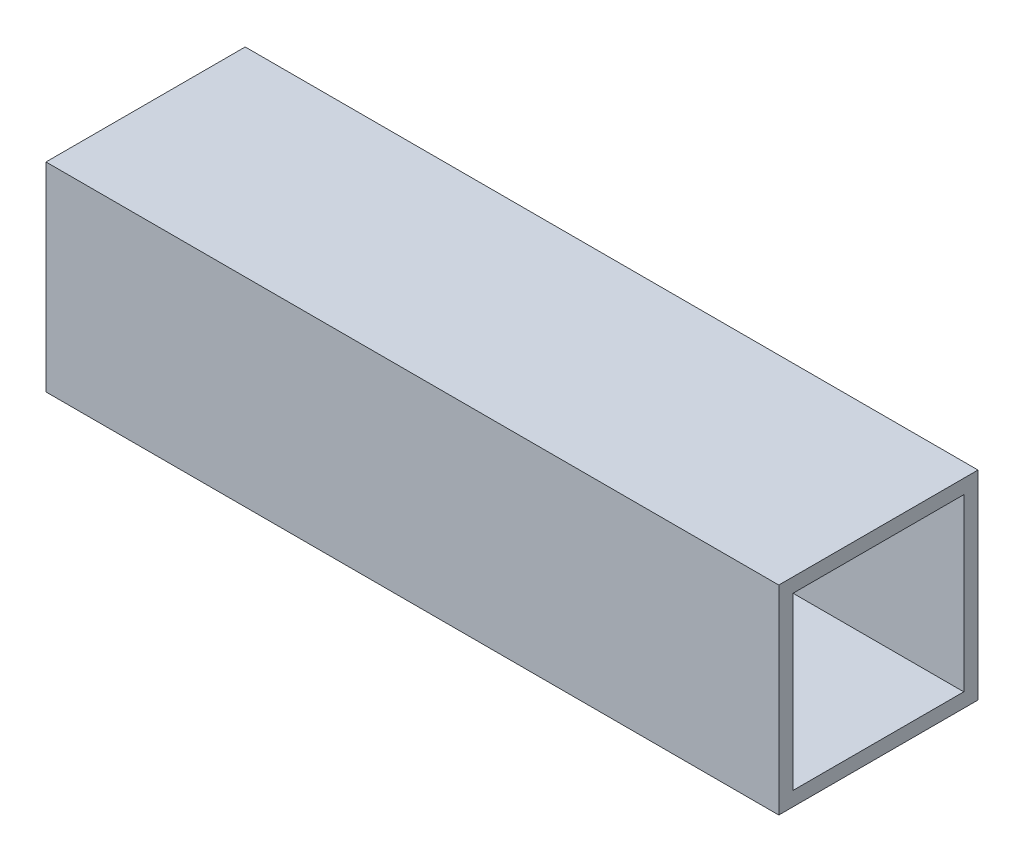
ISO-10303-21;
HEADER;
FILE_DESCRIPTION(('STEP AP214'),'2;1');
FILE_NAME('part.step','',(''),(''),'','','');
FILE_SCHEMA(('AUTOMOTIVE_DESIGN { 1 0 10303 214 1 1 1 1 }'));
ENDSEC;
DATA;
#1=APPLICATION_CONTEXT('core data for automotive mechanical design processes');
#2=APPLICATION_PROTOCOL_DEFINITION('international standard','automotive_design',2000,#1);
#3=PRODUCT_CONTEXT('',#1,'mechanical');
#4=PRODUCT('Part','Part','',(#3));
#5=PRODUCT_RELATED_PRODUCT_CATEGORY('part','',(#4));
#6=PRODUCT_DEFINITION_FORMATION('','',#4);
#7=PRODUCT_DEFINITION_CONTEXT('part definition',#1,'design');
#8=PRODUCT_DEFINITION('design','',#6,#7);
#9=PRODUCT_DEFINITION_SHAPE('','',#8);
#10=(LENGTH_UNIT() NAMED_UNIT(*) SI_UNIT(.MILLI.,.METRE.));
#11=(NAMED_UNIT(*) PLANE_ANGLE_UNIT() SI_UNIT($,.RADIAN.));
#12=(NAMED_UNIT(*) SI_UNIT($,.STERADIAN.) SOLID_ANGLE_UNIT());
#13=UNCERTAINTY_MEASURE_WITH_UNIT(LENGTH_MEASURE(1.E-05),#10,'distance_accuracy_value','');
#14=(GEOMETRIC_REPRESENTATION_CONTEXT(3) GLOBAL_UNCERTAINTY_ASSIGNED_CONTEXT((#13)) GLOBAL_UNIT_ASSIGNED_CONTEXT((#10,
#11,#12)) REPRESENTATION_CONTEXT('',''));
#15=CARTESIAN_POINT('',(0.,0.,0.));
#16=DIRECTION('',(0.,0.,1.));
#17=DIRECTION('',(1.,0.,0.));
#18=AXIS2_PLACEMENT_3D('',#15,#16,#17);
#19=CARTESIAN_POINT('',(-81.75625,-22.225,22.225));
#20=DIRECTION('',(0.,-1.,0.));
#21=DIRECTION('',(0.,0.,-1.));
#22=AXIS2_PLACEMENT_3D('',#19,#20,#21);
#23=PLANE('',#22);
#24=DIRECTION('',(1.,0.,0.));
#25=VECTOR('',#24,1.);
#26=CARTESIAN_POINT('',(-81.75625,-22.225,22.225));
#27=LINE('',#26,#25);
#28=CARTESIAN_POINT('',(-81.75625,-22.225,22.225));
#29=VERTEX_POINT('',#28);
#30=CARTESIAN_POINT('',(81.75625,-22.225,22.225));
#31=VERTEX_POINT('',#30);
#32=EDGE_CURVE('E114',#29,#31,#27,.T.);
#33=ORIENTED_EDGE('',*,*,#32,.F.);
#34=DIRECTION('',(0.,0.,-1.));
#35=VECTOR('',#34,1.);
#36=CARTESIAN_POINT('',(-81.75625,-22.225,0.));
#37=LINE('',#36,#35);
#38=CARTESIAN_POINT('',(-81.75625,-22.225,-22.225));
#39=VERTEX_POINT('',#38);
#40=EDGE_CURVE('E136',#29,#39,#37,.T.);
#41=ORIENTED_EDGE('',*,*,#40,.T.);
#42=DIRECTION('',(-1.,0.,0.));
#43=VECTOR('',#42,1.);
#44=CARTESIAN_POINT('',(-81.75625,-22.225,-22.225));
#45=LINE('',#44,#43);
#46=CARTESIAN_POINT('',(81.75625,-22.225,-22.225));
#47=VERTEX_POINT('',#46);
#48=EDGE_CURVE('E131',#47,#39,#45,.T.);
#49=ORIENTED_EDGE('',*,*,#48,.F.);
#50=DIRECTION('',(0.,0.,-1.));
#51=VECTOR('',#50,1.);
#52=CARTESIAN_POINT('',(81.75625,-22.225,0.));
#53=LINE('',#52,#51);
#54=EDGE_CURVE('E106',#31,#47,#53,.T.);
#55=ORIENTED_EDGE('',*,*,#54,.F.);
#56=EDGE_LOOP('',(#33,#41,#49,#55));
#57=FACE_BOUND('',#56,.T.);
#58=ADVANCED_FACE('F17',(#57),#23,.T.);
#59=CARTESIAN_POINT('',(-81.75625,19.05,-19.05));
#60=DIRECTION('',(0.,0.,1.));
#61=DIRECTION('',(1.,0.,0.));
#62=AXIS2_PLACEMENT_3D('',#59,#60,#61);
#63=PLANE('',#62);
#64=DIRECTION('',(1.,0.,0.));
#65=VECTOR('',#64,1.);
#66=CARTESIAN_POINT('',(-81.75625,19.05,-19.05));
#67=LINE('',#66,#65);
#68=CARTESIAN_POINT('',(-81.75625,19.05,-19.05));
#69=VERTEX_POINT('',#68);
#70=CARTESIAN_POINT('',(81.75625,19.05,-19.05));
#71=VERTEX_POINT('',#70);
#72=EDGE_CURVE('E91',#69,#71,#67,.T.);
#73=ORIENTED_EDGE('',*,*,#72,.F.);
#74=DIRECTION('',(0.,1.,0.));
#75=VECTOR('',#74,1.);
#76=CARTESIAN_POINT('',(-81.75625,0.,-19.05));
#77=LINE('',#76,#75);
#78=CARTESIAN_POINT('',(-81.75625,-19.05,-19.05));
#79=VERTEX_POINT('',#78);
#80=EDGE_CURVE('E139',#69,#79,#77,.F.);
#81=ORIENTED_EDGE('',*,*,#80,.T.);
#82=DIRECTION('',(1.,0.,0.));
#83=VECTOR('',#82,1.);
#84=CARTESIAN_POINT('',(-81.75625,-19.05,-19.05));
#85=LINE('',#84,#83);
#86=CARTESIAN_POINT('',(81.75625,-19.05,-19.05));
#87=VERTEX_POINT('',#86);
#88=EDGE_CURVE('E20',#87,#79,#85,.F.);
#89=ORIENTED_EDGE('',*,*,#88,.F.);
#90=DIRECTION('',(0.,1.,0.));
#91=VECTOR('',#90,1.);
#92=CARTESIAN_POINT('',(81.75625,0.,-19.05));
#93=LINE('',#92,#91);
#94=EDGE_CURVE('E105',#71,#87,#93,.F.);
#95=ORIENTED_EDGE('',*,*,#94,.F.);
#96=EDGE_LOOP('',(#73,#81,#89,#95));
#97=FACE_BOUND('',#96,.T.);
#98=ADVANCED_FACE('F125',(#97),#63,.T.);
#99=CARTESIAN_POINT('',(-81.75625,-19.05,-19.05));
#100=DIRECTION('',(0.,1.,0.));
#101=DIRECTION('',(0.,0.,1.));
#102=AXIS2_PLACEMENT_3D('',#99,#100,#101);
#103=PLANE('',#102);
#104=ORIENTED_EDGE('',*,*,#88,.T.);
#105=DIRECTION('',(0.,0.,-1.));
#106=VECTOR('',#105,1.);
#107=CARTESIAN_POINT('',(-81.75625,-19.05,0.));
#108=LINE('',#107,#106);
#109=CARTESIAN_POINT('',(-81.75625,-19.05,19.05));
#110=VERTEX_POINT('',#109);
#111=EDGE_CURVE('E88',#79,#110,#108,.F.);
#112=ORIENTED_EDGE('',*,*,#111,.T.);
#113=DIRECTION('',(-1.,0.,0.));
#114=VECTOR('',#113,1.);
#115=CARTESIAN_POINT('',(-81.75625,-19.05,19.05));
#116=LINE('',#115,#114);
#117=CARTESIAN_POINT('',(81.75625,-19.05,19.05));
#118=VERTEX_POINT('',#117);
#119=EDGE_CURVE('E80',#118,#110,#116,.T.);
#120=ORIENTED_EDGE('',*,*,#119,.F.);
#121=DIRECTION('',(0.,0.,-1.));
#122=VECTOR('',#121,1.);
#123=CARTESIAN_POINT('',(81.75625,-19.05,0.));
#124=LINE('',#123,#122);
#125=EDGE_CURVE('E85',#87,#118,#124,.F.);
#126=ORIENTED_EDGE('',*,*,#125,.F.);
#127=EDGE_LOOP('',(#104,#112,#120,#126));
#128=FACE_BOUND('',#127,.T.);
#129=ADVANCED_FACE('F83',(#128),#103,.T.);
#130=CARTESIAN_POINT('',(-81.75625,-19.05,19.05));
#131=DIRECTION('',(0.,0.,-1.));
#132=DIRECTION('',(-1.,0.,0.));
#133=AXIS2_PLACEMENT_3D('',#130,#131,#132);
#134=PLANE('',#133);
#135=ORIENTED_EDGE('',*,*,#119,.T.);
#136=DIRECTION('',(0.,1.,0.));
#137=VECTOR('',#136,1.);
#138=CARTESIAN_POINT('',(-81.75625,0.,19.05));
#139=LINE('',#138,#137);
#140=CARTESIAN_POINT('',(-81.75625,19.05,19.05));
#141=VERTEX_POINT('',#140);
#142=EDGE_CURVE('E142',#110,#141,#139,.T.);
#143=ORIENTED_EDGE('',*,*,#142,.T.);
#144=DIRECTION('',(1.,0.,0.));
#145=VECTOR('',#144,1.);
#146=CARTESIAN_POINT('',(-81.75625,19.05,19.05));
#147=LINE('',#146,#145);
#148=CARTESIAN_POINT('',(81.75625,19.05,19.05));
#149=VERTEX_POINT('',#148);
#150=EDGE_CURVE('E96',#149,#141,#147,.F.);
#151=ORIENTED_EDGE('',*,*,#150,.F.);
#152=DIRECTION('',(0.,1.,0.));
#153=VECTOR('',#152,1.);
#154=CARTESIAN_POINT('',(81.75625,0.,19.05));
#155=LINE('',#154,#153);
#156=EDGE_CURVE('E93',#118,#149,#155,.T.);
#157=ORIENTED_EDGE('',*,*,#156,.F.);
#158=EDGE_LOOP('',(#135,#143,#151,#157));
#159=FACE_BOUND('',#158,.T.);
#160=ADVANCED_FACE('F94',(#159),#134,.T.);
#161=CARTESIAN_POINT('',(-81.75625,19.05,19.05));
#162=DIRECTION('',(0.,-1.,0.));
#163=DIRECTION('',(0.,0.,-1.));
#164=AXIS2_PLACEMENT_3D('',#161,#162,#163);
#165=PLANE('',#164);
#166=ORIENTED_EDGE('',*,*,#150,.T.);
#167=DIRECTION('',(0.,0.,-1.));
#168=VECTOR('',#167,1.);
#169=CARTESIAN_POINT('',(-81.75625,19.05,0.));
#170=LINE('',#169,#168);
#171=EDGE_CURVE('E122',#141,#69,#170,.T.);
#172=ORIENTED_EDGE('',*,*,#171,.T.);
#173=ORIENTED_EDGE('',*,*,#72,.T.);
#174=DIRECTION('',(0.,0.,-1.));
#175=VECTOR('',#174,1.);
#176=CARTESIAN_POINT('',(81.75625,19.05,0.));
#177=LINE('',#176,#175);
#178=EDGE_CURVE('E100',#149,#71,#177,.T.);
#179=ORIENTED_EDGE('',*,*,#178,.F.);
#180=EDGE_LOOP('',(#166,#172,#173,#179));
#181=FACE_BOUND('',#180,.T.);
#182=ADVANCED_FACE('F120',(#181),#165,.T.);
#183=CARTESIAN_POINT('',(-81.75625,22.225,22.225));
#184=DIRECTION('',(0.,0.,1.));
#185=DIRECTION('',(1.,0.,0.));
#186=AXIS2_PLACEMENT_3D('',#183,#184,#185);
#187=PLANE('',#186);
#188=DIRECTION('',(1.,0.,0.));
#189=VECTOR('',#188,1.);
#190=CARTESIAN_POINT('',(-81.75625,22.225,22.225));
#191=LINE('',#190,#189);
#192=CARTESIAN_POINT('',(-81.75625,22.225,22.225));
#193=VERTEX_POINT('',#192);
#194=CARTESIAN_POINT('',(81.75625,22.225,22.225));
#195=VERTEX_POINT('',#194);
#196=EDGE_CURVE('E145',#193,#195,#191,.T.);
#197=ORIENTED_EDGE('',*,*,#196,.F.);
#198=DIRECTION('',(0.,1.,0.));
#199=VECTOR('',#198,1.);
#200=CARTESIAN_POINT('',(-81.75625,0.,22.225));
#201=LINE('',#200,#199);
#202=EDGE_CURVE('E133',#193,#29,#201,.F.);
#203=ORIENTED_EDGE('',*,*,#202,.T.);
#204=ORIENTED_EDGE('',*,*,#32,.T.);
#205=DIRECTION('',(0.,1.,0.));
#206=VECTOR('',#205,1.);
#207=CARTESIAN_POINT('',(81.75625,0.,22.225));
#208=LINE('',#207,#206);
#209=EDGE_CURVE('E108',#195,#31,#208,.F.);
#210=ORIENTED_EDGE('',*,*,#209,.F.);
#211=EDGE_LOOP('',(#197,#203,#204,#210));
#212=FACE_BOUND('',#211,.T.);
#213=ADVANCED_FACE('F164',(#212),#187,.T.);
#214=CARTESIAN_POINT('',(81.75625,0.,0.));
#215=DIRECTION('',(1.,0.,0.));
#216=DIRECTION('',(0.,0.,-1.));
#217=AXIS2_PLACEMENT_3D('',#214,#215,#216);
#218=PLANE('',#217);
#219=ORIENTED_EDGE('',*,*,#178,.T.);
#220=ORIENTED_EDGE('',*,*,#94,.T.);
#221=ORIENTED_EDGE('',*,*,#125,.T.);
#222=ORIENTED_EDGE('',*,*,#156,.T.);
#223=EDGE_LOOP('',(#219,#220,#221,#222));
#224=FACE_BOUND('',#223,.T.);
#225=DIRECTION('',(0.,1.,0.));
#226=VECTOR('',#225,1.);
#227=CARTESIAN_POINT('',(81.75625,-22.225,-22.225));
#228=LINE('',#227,#226);
#229=CARTESIAN_POINT('',(81.75625,22.225,-22.225));
#230=VERTEX_POINT('',#229);
#231=EDGE_CURVE('E126',#230,#47,#228,.F.);
#232=ORIENTED_EDGE('',*,*,#231,.F.);
#233=DIRECTION('',(0.,0.,1.));
#234=VECTOR('',#233,1.);
#235=CARTESIAN_POINT('',(81.75625,22.225,-22.225));
#236=LINE('',#235,#234);
#237=EDGE_CURVE('E148',#195,#230,#236,.F.);
#238=ORIENTED_EDGE('',*,*,#237,.F.);
#239=ORIENTED_EDGE('',*,*,#209,.T.);
#240=ORIENTED_EDGE('',*,*,#54,.T.);
#241=EDGE_LOOP('',(#232,#238,#239,#240));
#242=FACE_BOUND('',#241,.T.);
#243=ADVANCED_FACE('F102',(#224,#242),#218,.T.);
#244=CARTESIAN_POINT('',(-81.75625,-22.225,-22.225));
#245=DIRECTION('',(0.,0.,-1.));
#246=DIRECTION('',(-1.,0.,0.));
#247=AXIS2_PLACEMENT_3D('',#244,#245,#246);
#248=PLANE('',#247);
#249=ORIENTED_EDGE('',*,*,#48,.T.);
#250=DIRECTION('',(0.,1.,0.));
#251=VECTOR('',#250,1.);
#252=CARTESIAN_POINT('',(-81.75625,0.,-22.225));
#253=LINE('',#252,#251);
#254=CARTESIAN_POINT('',(-81.75625,22.225,-22.225));
#255=VERTEX_POINT('',#254);
#256=EDGE_CURVE('E35',#39,#255,#253,.T.);
#257=ORIENTED_EDGE('',*,*,#256,.T.);
#258=DIRECTION('',(1.,0.,0.));
#259=VECTOR('',#258,1.);
#260=CARTESIAN_POINT('',(-81.75625,22.225,-22.225));
#261=LINE('',#260,#259);
#262=EDGE_CURVE('E26',#230,#255,#261,.F.);
#263=ORIENTED_EDGE('',*,*,#262,.F.);
#264=ORIENTED_EDGE('',*,*,#231,.T.);
#265=EDGE_LOOP('',(#249,#257,#263,#264));
#266=FACE_BOUND('',#265,.T.);
#267=ADVANCED_FACE('F155',(#266),#248,.T.);
#268=CARTESIAN_POINT('',(-81.75625,0.,0.));
#269=DIRECTION('',(1.,0.,0.));
#270=DIRECTION('',(0.,0.,-1.));
#271=AXIS2_PLACEMENT_3D('',#268,#269,#270);
#272=PLANE('',#271);
#273=ORIENTED_EDGE('',*,*,#142,.F.);
#274=ORIENTED_EDGE('',*,*,#111,.F.);
#275=ORIENTED_EDGE('',*,*,#80,.F.);
#276=ORIENTED_EDGE('',*,*,#171,.F.);
#277=EDGE_LOOP('',(#273,#274,#275,#276));
#278=FACE_BOUND('',#277,.T.);
#279=ORIENTED_EDGE('',*,*,#40,.F.);
#280=ORIENTED_EDGE('',*,*,#202,.F.);
#281=DIRECTION('',(0.,0.,1.));
#282=VECTOR('',#281,1.);
#283=CARTESIAN_POINT('',(-81.75625,22.225,-22.225));
#284=LINE('',#283,#282);
#285=EDGE_CURVE('E11',#255,#193,#284,.T.);
#286=ORIENTED_EDGE('',*,*,#285,.F.);
#287=ORIENTED_EDGE('',*,*,#256,.F.);
#288=EDGE_LOOP('',(#279,#280,#286,#287));
#289=FACE_BOUND('',#288,.T.);
#290=ADVANCED_FACE('F162',(#278,#289),#272,.F.);
#291=CARTESIAN_POINT('',(-81.75625,22.225,-22.225));
#292=DIRECTION('',(0.,1.,0.));
#293=DIRECTION('',(0.,0.,1.));
#294=AXIS2_PLACEMENT_3D('',#291,#292,#293);
#295=PLANE('',#294);
#296=ORIENTED_EDGE('',*,*,#262,.T.);
#297=ORIENTED_EDGE('',*,*,#285,.T.);
#298=ORIENTED_EDGE('',*,*,#196,.T.);
#299=ORIENTED_EDGE('',*,*,#237,.T.);
#300=EDGE_LOOP('',(#296,#297,#298,#299));
#301=FACE_BOUND('',#300,.T.);
#302=ADVANCED_FACE('F153',(#301),#295,.T.);
#303=CLOSED_SHELL('',(#58,#98,#129,#160,#182,#213,#243,#267,#290,#302));
#304=MANIFOLD_SOLID_BREP('B1',#303);
#305=ADVANCED_BREP_SHAPE_REPRESENTATION('',(#18,#304),#14);
#306=SHAPE_DEFINITION_REPRESENTATION(#9,#305);
ENDSEC;
END-ISO-10303-21;
